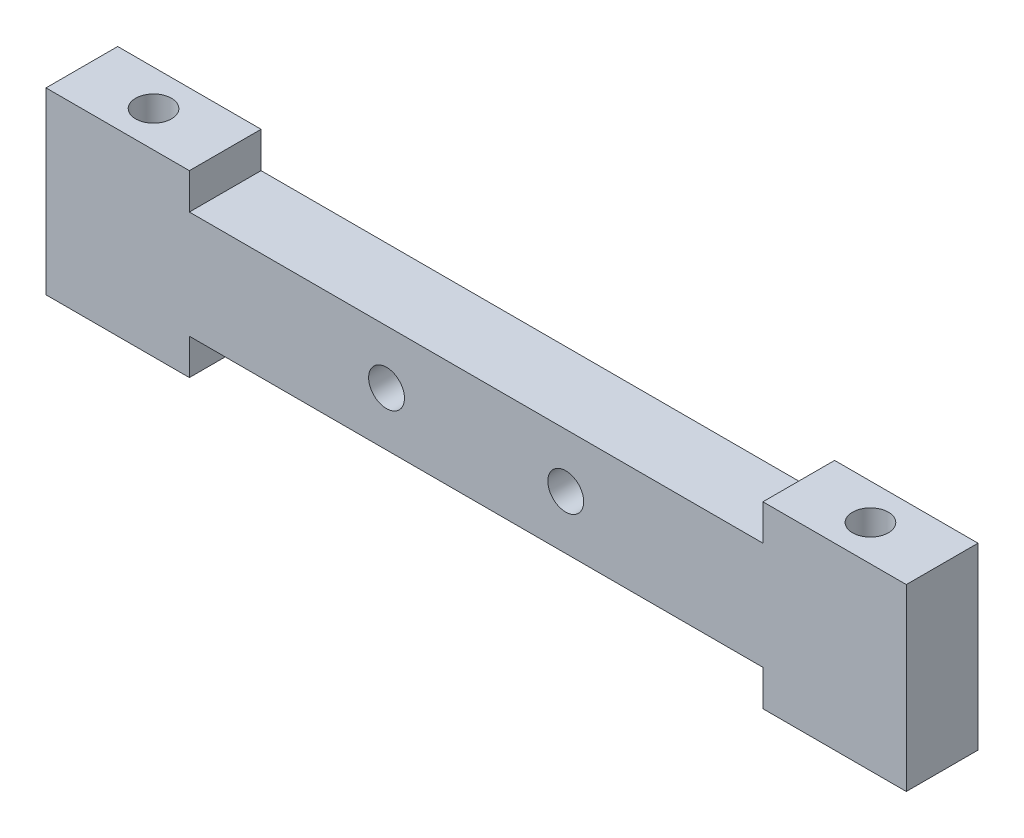
ISO-10303-21;
HEADER;
FILE_DESCRIPTION(('STEP AP214'),'2;1');
FILE_NAME('part.step','',(''),(''),'','','');
FILE_SCHEMA(('AUTOMOTIVE_DESIGN { 1 0 10303 214 1 1 1 1 }'));
ENDSEC;
DATA;
#1=APPLICATION_CONTEXT('core data for automotive mechanical design processes');
#2=APPLICATION_PROTOCOL_DEFINITION('international standard','automotive_design',2000,#1);
#3=PRODUCT_CONTEXT('',#1,'mechanical');
#4=PRODUCT('Part','Part','',(#3));
#5=PRODUCT_RELATED_PRODUCT_CATEGORY('part','',(#4));
#6=PRODUCT_DEFINITION_FORMATION('','',#4);
#7=PRODUCT_DEFINITION_CONTEXT('part definition',#1,'design');
#8=PRODUCT_DEFINITION('design','',#6,#7);
#9=PRODUCT_DEFINITION_SHAPE('','',#8);
#10=(LENGTH_UNIT() NAMED_UNIT(*) SI_UNIT(.MILLI.,.METRE.));
#11=(NAMED_UNIT(*) PLANE_ANGLE_UNIT() SI_UNIT($,.RADIAN.));
#12=(NAMED_UNIT(*) SI_UNIT($,.STERADIAN.) SOLID_ANGLE_UNIT());
#13=UNCERTAINTY_MEASURE_WITH_UNIT(LENGTH_MEASURE(1.E-05),#10,'distance_accuracy_value','');
#14=(GEOMETRIC_REPRESENTATION_CONTEXT(3) GLOBAL_UNCERTAINTY_ASSIGNED_CONTEXT((#13)) GLOBAL_UNIT_ASSIGNED_CONTEXT((#10,
#11,#12)) REPRESENTATION_CONTEXT('',''));
#15=CARTESIAN_POINT('',(0.,0.,0.));
#16=DIRECTION('',(0.,0.,1.));
#17=DIRECTION('',(1.,0.,0.));
#18=AXIS2_PLACEMENT_3D('',#15,#16,#17);
#19=CARTESIAN_POINT('',(0.,0.,10.));
#20=DIRECTION('',(0.,0.,1.));
#21=DIRECTION('',(1.,0.,0.));
#22=AXIS2_PLACEMENT_3D('',#19,#20,#21);
#23=PLANE('',#22);
#24=CARTESIAN_POINT('',(-24.5377471329066,0.,10.));
#25=DIRECTION('',(0.,0.,1.));
#26=DIRECTION('',(1.,0.,0.));
#27=AXIS2_PLACEMENT_3D('',#24,#25,#26);
#28=CIRCLE('',#27,5.);
#29=CARTESIAN_POINT('',(-19.5377471329066,0.,10.));
#30=VERTEX_POINT('',#29);
#31=EDGE_CURVE('E158',#30,#30,#28,.T.);
#32=ORIENTED_EDGE('',*,*,#31,.F.);
#33=EDGE_LOOP('',(#32));
#34=FACE_BOUND('',#33,.T.);
#35=DIRECTION('',(0.,-1.,0.));
#36=VECTOR('',#35,1.);
#37=CARTESIAN_POINT('',(-119.537747132907,25.,10.));
#38=LINE('',#37,#36);
#39=CARTESIAN_POINT('',(-119.537747132907,25.,10.));
#40=VERTEX_POINT('',#39);
#41=CARTESIAN_POINT('',(-119.537747132907,-25.,10.));
#42=VERTEX_POINT('',#41);
#43=EDGE_CURVE('E177',#40,#42,#38,.T.);
#44=ORIENTED_EDGE('',*,*,#43,.T.);
#45=DIRECTION('',(1.,0.,0.));
#46=VECTOR('',#45,1.);
#47=CARTESIAN_POINT('',(-119.537747132907,-25.,10.));
#48=LINE('',#47,#46);
#49=CARTESIAN_POINT('',(-79.5377471329065,-25.,10.));
#50=VERTEX_POINT('',#49);
#51=EDGE_CURVE('E105',#42,#50,#48,.T.);
#52=ORIENTED_EDGE('',*,*,#51,.T.);
#53=DIRECTION('',(0.,1.,0.));
#54=VECTOR('',#53,1.);
#55=CARTESIAN_POINT('',(-79.5377471329065,-25.,10.));
#56=LINE('',#55,#54);
#57=CARTESIAN_POINT('',(-79.5377471329065,-15.,10.));
#58=VERTEX_POINT('',#57);
#59=EDGE_CURVE('E204',#50,#58,#56,.T.);
#60=ORIENTED_EDGE('',*,*,#59,.T.);
#61=DIRECTION('',(1.,0.,0.));
#62=VECTOR('',#61,1.);
#63=CARTESIAN_POINT('',(-79.5377471329065,-15.,10.));
#64=LINE('',#63,#62);
#65=CARTESIAN_POINT('',(80.4622528670935,-14.9999999999999,10.));
#66=VERTEX_POINT('',#65);
#67=EDGE_CURVE('E223',#58,#66,#64,.T.);
#68=ORIENTED_EDGE('',*,*,#67,.T.);
#69=DIRECTION('',(0.,-1.,0.));
#70=VECTOR('',#69,1.);
#71=CARTESIAN_POINT('',(80.4622528670935,-14.9999999999999,10.));
#72=LINE('',#71,#70);
#73=CARTESIAN_POINT('',(80.4622528670935,-24.9999999999999,10.));
#74=VERTEX_POINT('',#73);
#75=EDGE_CURVE('E220',#66,#74,#72,.T.);
#76=ORIENTED_EDGE('',*,*,#75,.T.);
#77=DIRECTION('',(1.,0.,0.));
#78=VECTOR('',#77,1.);
#79=CARTESIAN_POINT('',(80.4622528670935,-24.9999999999999,10.));
#80=LINE('',#79,#78);
#81=CARTESIAN_POINT('',(120.462252867093,-25.0000000000001,10.));
#82=VERTEX_POINT('',#81);
#83=EDGE_CURVE('E222',#74,#82,#80,.T.);
#84=ORIENTED_EDGE('',*,*,#83,.T.);
#85=DIRECTION('',(0.,1.,0.));
#86=VECTOR('',#85,1.);
#87=CARTESIAN_POINT('',(120.462252867093,25.0000000000001,10.));
#88=LINE('',#87,#86);
#89=CARTESIAN_POINT('',(120.462252867093,25.0000000000001,10.));
#90=VERTEX_POINT('',#89);
#91=EDGE_CURVE('E225',#82,#90,#88,.T.);
#92=ORIENTED_EDGE('',*,*,#91,.T.);
#93=DIRECTION('',(-1.,0.,0.));
#94=VECTOR('',#93,1.);
#95=CARTESIAN_POINT('',(80.4622528670934,25.0000000000001,10.));
#96=LINE('',#95,#94);
#97=CARTESIAN_POINT('',(80.4622528670934,25.0000000000001,10.));
#98=VERTEX_POINT('',#97);
#99=EDGE_CURVE('E231',#90,#98,#96,.T.);
#100=ORIENTED_EDGE('',*,*,#99,.T.);
#101=DIRECTION('',(0.,-1.,0.));
#102=VECTOR('',#101,1.);
#103=CARTESIAN_POINT('',(80.4622528670934,15.,10.));
#104=LINE('',#103,#102);
#105=CARTESIAN_POINT('',(80.4622528670934,15.,10.));
#106=VERTEX_POINT('',#105);
#107=EDGE_CURVE('E136',#98,#106,#104,.T.);
#108=ORIENTED_EDGE('',*,*,#107,.T.);
#109=DIRECTION('',(-1.,0.,0.));
#110=VECTOR('',#109,1.);
#111=CARTESIAN_POINT('',(-79.5377471329066,15.,10.));
#112=LINE('',#111,#110);
#113=CARTESIAN_POINT('',(-79.5377471329066,15.,10.));
#114=VERTEX_POINT('',#113);
#115=EDGE_CURVE('E130',#106,#114,#112,.T.);
#116=ORIENTED_EDGE('',*,*,#115,.T.);
#117=DIRECTION('',(0.,1.,0.));
#118=VECTOR('',#117,1.);
#119=CARTESIAN_POINT('',(-79.5377471329066,25.,10.));
#120=LINE('',#119,#118);
#121=CARTESIAN_POINT('',(-79.5377471329066,25.,10.));
#122=VERTEX_POINT('',#121);
#123=EDGE_CURVE('E134',#114,#122,#120,.T.);
#124=ORIENTED_EDGE('',*,*,#123,.T.);
#125=DIRECTION('',(-1.,0.,0.));
#126=VECTOR('',#125,1.);
#127=CARTESIAN_POINT('',(-119.537747132907,25.,10.));
#128=LINE('',#127,#126);
#129=EDGE_CURVE('E50',#122,#40,#128,.T.);
#130=ORIENTED_EDGE('',*,*,#129,.T.);
#131=EDGE_LOOP('',(#44,#52,#60,#68,#76,#84,#92,#100,#108,#116,#124,#130));
#132=FACE_BOUND('',#131,.T.);
#133=CARTESIAN_POINT('',(25.4622528670934,0.,10.));
#134=DIRECTION('',(0.,0.,1.));
#135=DIRECTION('',(1.,0.,0.));
#136=AXIS2_PLACEMENT_3D('',#133,#134,#135);
#137=CIRCLE('',#136,5.);
#138=CARTESIAN_POINT('',(30.4622528670934,0.,10.));
#139=VERTEX_POINT('',#138);
#140=EDGE_CURVE('E299',#139,#139,#137,.T.);
#141=ORIENTED_EDGE('',*,*,#140,.F.);
#142=EDGE_LOOP('',(#141));
#143=FACE_BOUND('',#142,.T.);
#144=ADVANCED_FACE('F33',(#34,#132,#143),#23,.T.);
#145=CARTESIAN_POINT('',(0.,0.,-10.));
#146=DIRECTION('',(0.,0.,1.));
#147=DIRECTION('',(1.,0.,0.));
#148=AXIS2_PLACEMENT_3D('',#145,#146,#147);
#149=PLANE('',#148);
#150=CARTESIAN_POINT('',(-24.5377471329066,0.,-10.));
#151=DIRECTION('',(0.,0.,1.));
#152=DIRECTION('',(1.,0.,0.));
#153=AXIS2_PLACEMENT_3D('',#150,#151,#152);
#154=CIRCLE('',#153,5.);
#155=CARTESIAN_POINT('',(-19.5377471329066,0.,-10.));
#156=VERTEX_POINT('',#155);
#157=EDGE_CURVE('E302',#156,#156,#154,.T.);
#158=ORIENTED_EDGE('',*,*,#157,.T.);
#159=EDGE_LOOP('',(#158));
#160=FACE_BOUND('',#159,.T.);
#161=DIRECTION('',(0.,-1.,0.));
#162=VECTOR('',#161,1.);
#163=CARTESIAN_POINT('',(-119.537747132907,25.,-10.));
#164=LINE('',#163,#162);
#165=CARTESIAN_POINT('',(-119.537747132907,25.,-10.));
#166=VERTEX_POINT('',#165);
#167=CARTESIAN_POINT('',(-119.537747132907,-25.,-10.));
#168=VERTEX_POINT('',#167);
#169=EDGE_CURVE('E154',#166,#168,#164,.T.);
#170=ORIENTED_EDGE('',*,*,#169,.F.);
#171=DIRECTION('',(-1.,0.,0.));
#172=VECTOR('',#171,1.);
#173=CARTESIAN_POINT('',(-119.537747132907,25.,-10.));
#174=LINE('',#173,#172);
#175=CARTESIAN_POINT('',(-79.5377471329066,25.,-10.));
#176=VERTEX_POINT('',#175);
#177=EDGE_CURVE('E97',#176,#166,#174,.T.);
#178=ORIENTED_EDGE('',*,*,#177,.F.);
#179=DIRECTION('',(0.,1.,0.));
#180=VECTOR('',#179,1.);
#181=CARTESIAN_POINT('',(-79.5377471329066,25.,-10.));
#182=LINE('',#181,#180);
#183=CARTESIAN_POINT('',(-79.5377471329066,15.,-10.));
#184=VERTEX_POINT('',#183);
#185=EDGE_CURVE('E91',#184,#176,#182,.T.);
#186=ORIENTED_EDGE('',*,*,#185,.F.);
#187=DIRECTION('',(-1.,0.,0.));
#188=VECTOR('',#187,1.);
#189=CARTESIAN_POINT('',(-79.5377471329066,15.,-10.));
#190=LINE('',#189,#188);
#191=CARTESIAN_POINT('',(80.4622528670934,15.,-10.));
#192=VERTEX_POINT('',#191);
#193=EDGE_CURVE('E144',#192,#184,#190,.T.);
#194=ORIENTED_EDGE('',*,*,#193,.F.);
#195=DIRECTION('',(0.,-1.,0.));
#196=VECTOR('',#195,1.);
#197=CARTESIAN_POINT('',(80.4622528670934,15.,-10.));
#198=LINE('',#197,#196);
#199=CARTESIAN_POINT('',(80.4622528670934,25.0000000000001,-10.));
#200=VERTEX_POINT('',#199);
#201=EDGE_CURVE('E172',#200,#192,#198,.T.);
#202=ORIENTED_EDGE('',*,*,#201,.F.);
#203=DIRECTION('',(-1.,0.,0.));
#204=VECTOR('',#203,1.);
#205=CARTESIAN_POINT('',(80.4622528670934,25.0000000000001,-10.));
#206=LINE('',#205,#204);
#207=CARTESIAN_POINT('',(120.462252867093,25.0000000000001,-10.));
#208=VERTEX_POINT('',#207);
#209=EDGE_CURVE('E170',#208,#200,#206,.T.);
#210=ORIENTED_EDGE('',*,*,#209,.F.);
#211=DIRECTION('',(0.,1.,0.));
#212=VECTOR('',#211,1.);
#213=CARTESIAN_POINT('',(120.462252867093,25.0000000000001,-10.));
#214=LINE('',#213,#212);
#215=CARTESIAN_POINT('',(120.462252867093,-25.0000000000001,-10.));
#216=VERTEX_POINT('',#215);
#217=EDGE_CURVE('E168',#216,#208,#214,.T.);
#218=ORIENTED_EDGE('',*,*,#217,.F.);
#219=DIRECTION('',(1.,0.,0.));
#220=VECTOR('',#219,1.);
#221=CARTESIAN_POINT('',(80.4622528670935,-24.9999999999999,-10.));
#222=LINE('',#221,#220);
#223=CARTESIAN_POINT('',(80.4622528670935,-24.9999999999999,-10.));
#224=VERTEX_POINT('',#223);
#225=EDGE_CURVE('E166',#224,#216,#222,.T.);
#226=ORIENTED_EDGE('',*,*,#225,.F.);
#227=DIRECTION('',(0.,-1.,0.));
#228=VECTOR('',#227,1.);
#229=CARTESIAN_POINT('',(80.4622528670935,-14.9999999999999,-10.));
#230=LINE('',#229,#228);
#231=CARTESIAN_POINT('',(80.4622528670935,-14.9999999999999,-10.));
#232=VERTEX_POINT('',#231);
#233=EDGE_CURVE('E164',#232,#224,#230,.T.);
#234=ORIENTED_EDGE('',*,*,#233,.F.);
#235=DIRECTION('',(1.,0.,0.));
#236=VECTOR('',#235,1.);
#237=CARTESIAN_POINT('',(-79.5377471329065,-15.,-10.));
#238=LINE('',#237,#236);
#239=CARTESIAN_POINT('',(-79.5377471329065,-15.,-10.));
#240=VERTEX_POINT('',#239);
#241=EDGE_CURVE('E162',#240,#232,#238,.T.);
#242=ORIENTED_EDGE('',*,*,#241,.F.);
#243=DIRECTION('',(0.,1.,0.));
#244=VECTOR('',#243,1.);
#245=CARTESIAN_POINT('',(-79.5377471329065,-25.,-10.));
#246=LINE('',#245,#244);
#247=CARTESIAN_POINT('',(-79.5377471329065,-25.,-10.));
#248=VERTEX_POINT('',#247);
#249=EDGE_CURVE('E160',#248,#240,#246,.T.);
#250=ORIENTED_EDGE('',*,*,#249,.F.);
#251=DIRECTION('',(1.,0.,0.));
#252=VECTOR('',#251,1.);
#253=CARTESIAN_POINT('',(-119.537747132907,-25.,-10.));
#254=LINE('',#253,#252);
#255=EDGE_CURVE('E157',#168,#248,#254,.T.);
#256=ORIENTED_EDGE('',*,*,#255,.F.);
#257=EDGE_LOOP('',(#170,#178,#186,#194,#202,#210,#218,#226,#234,#242,#250,#256));
#258=FACE_BOUND('',#257,.T.);
#259=CARTESIAN_POINT('',(25.4622528670934,0.,-10.));
#260=DIRECTION('',(0.,0.,1.));
#261=DIRECTION('',(1.,0.,0.));
#262=AXIS2_PLACEMENT_3D('',#259,#260,#261);
#263=CIRCLE('',#262,5.);
#264=CARTESIAN_POINT('',(30.4622528670934,0.,-10.));
#265=VERTEX_POINT('',#264);
#266=EDGE_CURVE('E296',#265,#265,#263,.T.);
#267=ORIENTED_EDGE('',*,*,#266,.T.);
#268=EDGE_LOOP('',(#267));
#269=FACE_BOUND('',#268,.T.);
#270=ADVANCED_FACE('F208',(#160,#258,#269),#149,.F.);
#271=CARTESIAN_POINT('',(-119.537747132907,25.,10.));
#272=DIRECTION('',(1.,0.,0.));
#273=DIRECTION('',(0.,0.,-1.));
#274=AXIS2_PLACEMENT_3D('',#271,#272,#273);
#275=PLANE('',#274);
#276=ORIENTED_EDGE('',*,*,#169,.T.);
#277=DIRECTION('',(0.,0.,-1.));
#278=VECTOR('',#277,1.);
#279=CARTESIAN_POINT('',(-119.537747132907,-25.,10.));
#280=LINE('',#279,#278);
#281=EDGE_CURVE('E11',#42,#168,#280,.T.);
#282=ORIENTED_EDGE('',*,*,#281,.F.);
#283=ORIENTED_EDGE('',*,*,#43,.F.);
#284=DIRECTION('',(0.,0.,-1.));
#285=VECTOR('',#284,1.);
#286=CARTESIAN_POINT('',(-119.537747132907,25.,10.));
#287=LINE('',#286,#285);
#288=EDGE_CURVE('E150',#40,#166,#287,.T.);
#289=ORIENTED_EDGE('',*,*,#288,.T.);
#290=EDGE_LOOP('',(#276,#282,#283,#289));
#291=FACE_BOUND('',#290,.T.);
#292=ADVANCED_FACE('F35',(#291),#275,.F.);
#293=CARTESIAN_POINT('',(-119.537747132907,-25.,10.));
#294=DIRECTION('',(0.,1.,0.));
#295=DIRECTION('',(-1.,0.,0.));
#296=AXIS2_PLACEMENT_3D('',#293,#294,#295);
#297=PLANE('',#296);
#298=CARTESIAN_POINT('',(-99.5377471329065,-25.0000000000001,0.));
#299=DIRECTION('',(0.,1.,0.));
#300=DIRECTION('',(-1.,0.,0.));
#301=AXIS2_PLACEMENT_3D('',#298,#299,#300);
#302=CIRCLE('',#301,5.);
#303=CARTESIAN_POINT('',(-104.537747132907,-25.0000000000001,0.));
#304=VERTEX_POINT('',#303);
#305=EDGE_CURVE('E293',#304,#304,#302,.T.);
#306=ORIENTED_EDGE('',*,*,#305,.T.);
#307=EDGE_LOOP('',(#306));
#308=FACE_BOUND('',#307,.T.);
#309=ORIENTED_EDGE('',*,*,#255,.T.);
#310=DIRECTION('',(0.,0.,-1.));
#311=VECTOR('',#310,1.);
#312=CARTESIAN_POINT('',(-79.5377471329065,-25.,10.));
#313=LINE('',#312,#311);
#314=EDGE_CURVE('E42',#50,#248,#313,.T.);
#315=ORIENTED_EDGE('',*,*,#314,.F.);
#316=ORIENTED_EDGE('',*,*,#51,.F.);
#317=ORIENTED_EDGE('',*,*,#281,.T.);
#318=EDGE_LOOP('',(#309,#315,#316,#317));
#319=FACE_BOUND('',#318,.T.);
#320=ADVANCED_FACE('F318',(#308,#319),#297,.F.);
#321=CARTESIAN_POINT('',(-79.5377471329065,-25.,10.));
#322=DIRECTION('',(-1.,0.,0.));
#323=DIRECTION('',(0.,0.,1.));
#324=AXIS2_PLACEMENT_3D('',#321,#322,#323);
#325=PLANE('',#324);
#326=ORIENTED_EDGE('',*,*,#249,.T.);
#327=DIRECTION('',(0.,0.,-1.));
#328=VECTOR('',#327,1.);
#329=CARTESIAN_POINT('',(-79.5377471329065,-15.,10.));
#330=LINE('',#329,#328);
#331=EDGE_CURVE('E196',#58,#240,#330,.T.);
#332=ORIENTED_EDGE('',*,*,#331,.F.);
#333=ORIENTED_EDGE('',*,*,#59,.F.);
#334=ORIENTED_EDGE('',*,*,#314,.T.);
#335=EDGE_LOOP('',(#326,#332,#333,#334));
#336=FACE_BOUND('',#335,.T.);
#337=ADVANCED_FACE('F202',(#336),#325,.F.);
#338=CARTESIAN_POINT('',(-79.5377471329065,-15.,10.));
#339=DIRECTION('',(0.,1.,0.));
#340=DIRECTION('',(-1.,0.,0.));
#341=AXIS2_PLACEMENT_3D('',#338,#339,#340);
#342=PLANE('',#341);
#343=ORIENTED_EDGE('',*,*,#241,.T.);
#344=DIRECTION('',(0.,0.,-1.));
#345=VECTOR('',#344,1.);
#346=CARTESIAN_POINT('',(80.4622528670935,-14.9999999999999,10.));
#347=LINE('',#346,#345);
#348=EDGE_CURVE('E193',#66,#232,#347,.T.);
#349=ORIENTED_EDGE('',*,*,#348,.F.);
#350=ORIENTED_EDGE('',*,*,#67,.F.);
#351=ORIENTED_EDGE('',*,*,#331,.T.);
#352=EDGE_LOOP('',(#343,#349,#350,#351));
#353=FACE_BOUND('',#352,.T.);
#354=ADVANCED_FACE('F214',(#353),#342,.F.);
#355=CARTESIAN_POINT('',(80.4622528670935,-14.9999999999999,10.));
#356=DIRECTION('',(1.,0.,0.));
#357=DIRECTION('',(0.,0.,-1.));
#358=AXIS2_PLACEMENT_3D('',#355,#356,#357);
#359=PLANE('',#358);
#360=ORIENTED_EDGE('',*,*,#233,.T.);
#361=DIRECTION('',(0.,0.,-1.));
#362=VECTOR('',#361,1.);
#363=CARTESIAN_POINT('',(80.4622528670935,-24.9999999999999,10.));
#364=LINE('',#363,#362);
#365=EDGE_CURVE('E190',#74,#224,#364,.T.);
#366=ORIENTED_EDGE('',*,*,#365,.F.);
#367=ORIENTED_EDGE('',*,*,#75,.F.);
#368=ORIENTED_EDGE('',*,*,#348,.T.);
#369=EDGE_LOOP('',(#360,#366,#367,#368));
#370=FACE_BOUND('',#369,.T.);
#371=ADVANCED_FACE('F218',(#370),#359,.F.);
#372=CARTESIAN_POINT('',(80.4622528670935,-24.9999999999999,10.));
#373=DIRECTION('',(0.,1.,0.));
#374=DIRECTION('',(-1.,0.,0.));
#375=AXIS2_PLACEMENT_3D('',#372,#373,#374);
#376=PLANE('',#375);
#377=CARTESIAN_POINT('',(100.462252867093,-25.0000000000001,0.));
#378=DIRECTION('',(0.,1.,0.));
#379=DIRECTION('',(-1.,0.,0.));
#380=AXIS2_PLACEMENT_3D('',#377,#378,#379);
#381=CIRCLE('',#380,5.);
#382=CARTESIAN_POINT('',(95.4622528670935,-25.0000000000001,0.));
#383=VERTEX_POINT('',#382);
#384=EDGE_CURVE('E284',#383,#383,#381,.T.);
#385=ORIENTED_EDGE('',*,*,#384,.T.);
#386=EDGE_LOOP('',(#385));
#387=FACE_BOUND('',#386,.T.);
#388=ORIENTED_EDGE('',*,*,#225,.T.);
#389=DIRECTION('',(0.,0.,-1.));
#390=VECTOR('',#389,1.);
#391=CARTESIAN_POINT('',(120.462252867093,-25.0000000000001,10.));
#392=LINE('',#391,#390);
#393=EDGE_CURVE('E187',#82,#216,#392,.T.);
#394=ORIENTED_EDGE('',*,*,#393,.F.);
#395=ORIENTED_EDGE('',*,*,#83,.F.);
#396=ORIENTED_EDGE('',*,*,#365,.T.);
#397=EDGE_LOOP('',(#388,#394,#395,#396));
#398=FACE_BOUND('',#397,.T.);
#399=ADVANCED_FACE('F330',(#387,#398),#376,.F.);
#400=CARTESIAN_POINT('',(120.462252867093,25.0000000000001,10.));
#401=DIRECTION('',(-1.,0.,0.));
#402=DIRECTION('',(0.,0.,1.));
#403=AXIS2_PLACEMENT_3D('',#400,#401,#402);
#404=PLANE('',#403);
#405=ORIENTED_EDGE('',*,*,#217,.T.);
#406=DIRECTION('',(0.,0.,-1.));
#407=VECTOR('',#406,1.);
#408=CARTESIAN_POINT('',(120.462252867093,25.0000000000001,10.));
#409=LINE('',#408,#407);
#410=EDGE_CURVE('E184',#90,#208,#409,.T.);
#411=ORIENTED_EDGE('',*,*,#410,.F.);
#412=ORIENTED_EDGE('',*,*,#91,.F.);
#413=ORIENTED_EDGE('',*,*,#393,.T.);
#414=EDGE_LOOP('',(#405,#411,#412,#413));
#415=FACE_BOUND('',#414,.T.);
#416=ADVANCED_FACE('F333',(#415),#404,.F.);
#417=CARTESIAN_POINT('',(80.4622528670934,25.0000000000001,10.));
#418=DIRECTION('',(0.,-1.,0.));
#419=DIRECTION('',(0.,0.,-1.));
#420=AXIS2_PLACEMENT_3D('',#417,#418,#419);
#421=PLANE('',#420);
#422=CARTESIAN_POINT('',(100.462252867093,25.0000000000001,0.));
#423=DIRECTION('',(0.,1.,0.));
#424=DIRECTION('',(-1.,0.,0.));
#425=AXIS2_PLACEMENT_3D('',#422,#423,#424);
#426=CIRCLE('',#425,5.);
#427=CARTESIAN_POINT('',(95.4622528670934,25.0000000000001,0.));
#428=VERTEX_POINT('',#427);
#429=EDGE_CURVE('E287',#428,#428,#426,.T.);
#430=ORIENTED_EDGE('',*,*,#429,.F.);
#431=EDGE_LOOP('',(#430));
#432=FACE_BOUND('',#431,.T.);
#433=ORIENTED_EDGE('',*,*,#209,.T.);
#434=DIRECTION('',(0.,0.,-1.));
#435=VECTOR('',#434,1.);
#436=CARTESIAN_POINT('',(80.4622528670934,25.0000000000001,10.));
#437=LINE('',#436,#435);
#438=EDGE_CURVE('E181',#98,#200,#437,.T.);
#439=ORIENTED_EDGE('',*,*,#438,.F.);
#440=ORIENTED_EDGE('',*,*,#99,.F.);
#441=ORIENTED_EDGE('',*,*,#410,.T.);
#442=EDGE_LOOP('',(#433,#439,#440,#441));
#443=FACE_BOUND('',#442,.T.);
#444=ADVANCED_FACE('F237',(#432,#443),#421,.F.);
#445=CARTESIAN_POINT('',(80.4622528670934,15.,10.));
#446=DIRECTION('',(1.,0.,0.));
#447=DIRECTION('',(0.,0.,-1.));
#448=AXIS2_PLACEMENT_3D('',#445,#446,#447);
#449=PLANE('',#448);
#450=ORIENTED_EDGE('',*,*,#201,.T.);
#451=DIRECTION('',(0.,0.,-1.));
#452=VECTOR('',#451,1.);
#453=CARTESIAN_POINT('',(80.4622528670934,15.,10.));
#454=LINE('',#453,#452);
#455=EDGE_CURVE('E145',#106,#192,#454,.T.);
#456=ORIENTED_EDGE('',*,*,#455,.F.);
#457=ORIENTED_EDGE('',*,*,#107,.F.);
#458=ORIENTED_EDGE('',*,*,#438,.T.);
#459=EDGE_LOOP('',(#450,#456,#457,#458));
#460=FACE_BOUND('',#459,.T.);
#461=ADVANCED_FACE('F241',(#460),#449,.F.);
#462=CARTESIAN_POINT('',(-79.5377471329066,15.,10.));
#463=DIRECTION('',(0.,-1.,0.));
#464=DIRECTION('',(0.,0.,-1.));
#465=AXIS2_PLACEMENT_3D('',#462,#463,#464);
#466=PLANE('',#465);
#467=ORIENTED_EDGE('',*,*,#193,.T.);
#468=DIRECTION('',(0.,0.,-1.));
#469=VECTOR('',#468,1.);
#470=CARTESIAN_POINT('',(-79.5377471329066,15.,10.));
#471=LINE('',#470,#469);
#472=EDGE_CURVE('E141',#114,#184,#471,.T.);
#473=ORIENTED_EDGE('',*,*,#472,.F.);
#474=ORIENTED_EDGE('',*,*,#115,.F.);
#475=ORIENTED_EDGE('',*,*,#455,.T.);
#476=EDGE_LOOP('',(#467,#473,#474,#475));
#477=FACE_BOUND('',#476,.T.);
#478=ADVANCED_FACE('F142',(#477),#466,.F.);
#479=CARTESIAN_POINT('',(-79.5377471329066,25.,10.));
#480=DIRECTION('',(-1.,0.,0.));
#481=DIRECTION('',(0.,0.,1.));
#482=AXIS2_PLACEMENT_3D('',#479,#480,#481);
#483=PLANE('',#482);
#484=ORIENTED_EDGE('',*,*,#185,.T.);
#485=DIRECTION('',(0.,0.,-1.));
#486=VECTOR('',#485,1.);
#487=CARTESIAN_POINT('',(-79.5377471329066,25.,10.));
#488=LINE('',#487,#486);
#489=EDGE_CURVE('E146',#122,#176,#488,.T.);
#490=ORIENTED_EDGE('',*,*,#489,.F.);
#491=ORIENTED_EDGE('',*,*,#123,.F.);
#492=ORIENTED_EDGE('',*,*,#472,.T.);
#493=EDGE_LOOP('',(#484,#490,#491,#492));
#494=FACE_BOUND('',#493,.T.);
#495=ADVANCED_FACE('F148',(#494),#483,.F.);
#496=CARTESIAN_POINT('',(-119.537747132907,25.,10.));
#497=DIRECTION('',(0.,-1.,0.));
#498=DIRECTION('',(1.,0.,0.));
#499=AXIS2_PLACEMENT_3D('',#496,#497,#498);
#500=PLANE('',#499);
#501=CARTESIAN_POINT('',(-99.5377471329066,25.,0.));
#502=DIRECTION('',(0.,1.,0.));
#503=DIRECTION('',(-1.,0.,0.));
#504=AXIS2_PLACEMENT_3D('',#501,#502,#503);
#505=CIRCLE('',#504,5.);
#506=CARTESIAN_POINT('',(-104.537747132907,25.,0.));
#507=VERTEX_POINT('',#506);
#508=EDGE_CURVE('E290',#507,#507,#505,.T.);
#509=ORIENTED_EDGE('',*,*,#508,.F.);
#510=EDGE_LOOP('',(#509));
#511=FACE_BOUND('',#510,.T.);
#512=ORIENTED_EDGE('',*,*,#177,.T.);
#513=ORIENTED_EDGE('',*,*,#288,.F.);
#514=ORIENTED_EDGE('',*,*,#129,.F.);
#515=ORIENTED_EDGE('',*,*,#489,.T.);
#516=EDGE_LOOP('',(#512,#513,#514,#515));
#517=FACE_BOUND('',#516,.T.);
#518=ADVANCED_FACE('F245',(#511,#517),#500,.F.);
#519=CARTESIAN_POINT('',(-24.5377471329066,0.,10.));
#520=DIRECTION('',(0.,0.,-1.));
#521=DIRECTION('',(-1.,0.,0.));
#522=AXIS2_PLACEMENT_3D('',#519,#520,#521);
#523=CYLINDRICAL_SURFACE('',#522,5.);
#524=ORIENTED_EDGE('',*,*,#31,.T.);
#525=EDGE_LOOP('',(#524));
#526=FACE_BOUND('',#525,.T.);
#527=ORIENTED_EDGE('',*,*,#157,.F.);
#528=EDGE_LOOP('',(#527));
#529=FACE_BOUND('',#528,.T.);
#530=ADVANCED_FACE('F247',(#526,#529),#523,.F.);
#531=CARTESIAN_POINT('',(25.4622528670934,0.,10.));
#532=DIRECTION('',(0.,0.,-1.));
#533=DIRECTION('',(-1.,0.,0.));
#534=AXIS2_PLACEMENT_3D('',#531,#532,#533);
#535=CYLINDRICAL_SURFACE('',#534,5.);
#536=ORIENTED_EDGE('',*,*,#140,.T.);
#537=EDGE_LOOP('',(#536));
#538=FACE_BOUND('',#537,.T.);
#539=ORIENTED_EDGE('',*,*,#266,.F.);
#540=EDGE_LOOP('',(#539));
#541=FACE_BOUND('',#540,.T.);
#542=ADVANCED_FACE('F254',(#538,#541),#535,.F.);
#543=CARTESIAN_POINT('',(-99.5377471329065,-25.0000000000001,0.));
#544=DIRECTION('',(0.,1.,0.));
#545=DIRECTION('',(-1.,0.,0.));
#546=AXIS2_PLACEMENT_3D('',#543,#544,#545);
#547=CYLINDRICAL_SURFACE('',#546,5.);
#548=ORIENTED_EDGE('',*,*,#305,.F.);
#549=EDGE_LOOP('',(#548));
#550=FACE_BOUND('',#549,.T.);
#551=ORIENTED_EDGE('',*,*,#508,.T.);
#552=EDGE_LOOP('',(#551));
#553=FACE_BOUND('',#552,.T.);
#554=ADVANCED_FACE('F271',(#550,#553),#547,.F.);
#555=CARTESIAN_POINT('',(100.462252867093,-25.0000000000001,0.));
#556=DIRECTION('',(0.,1.,0.));
#557=DIRECTION('',(-1.,0.,0.));
#558=AXIS2_PLACEMENT_3D('',#555,#556,#557);
#559=CYLINDRICAL_SURFACE('',#558,5.);
#560=ORIENTED_EDGE('',*,*,#384,.F.);
#561=EDGE_LOOP('',(#560));
#562=FACE_BOUND('',#561,.T.);
#563=ORIENTED_EDGE('',*,*,#429,.T.);
#564=EDGE_LOOP('',(#563));
#565=FACE_BOUND('',#564,.T.);
#566=ADVANCED_FACE('F275',(#562,#565),#559,.F.);
#567=CLOSED_SHELL('',(#144,#270,#292,#320,#337,#354,#371,#399,#416,#444,#461,#478,#495,#518,
#530,#542,#554,#566));
#568=MANIFOLD_SOLID_BREP('B2',#567);
#569=ADVANCED_BREP_SHAPE_REPRESENTATION('',(#18,#568),#14);
#570=SHAPE_DEFINITION_REPRESENTATION(#9,#569);
ENDSEC;
END-ISO-10303-21;
